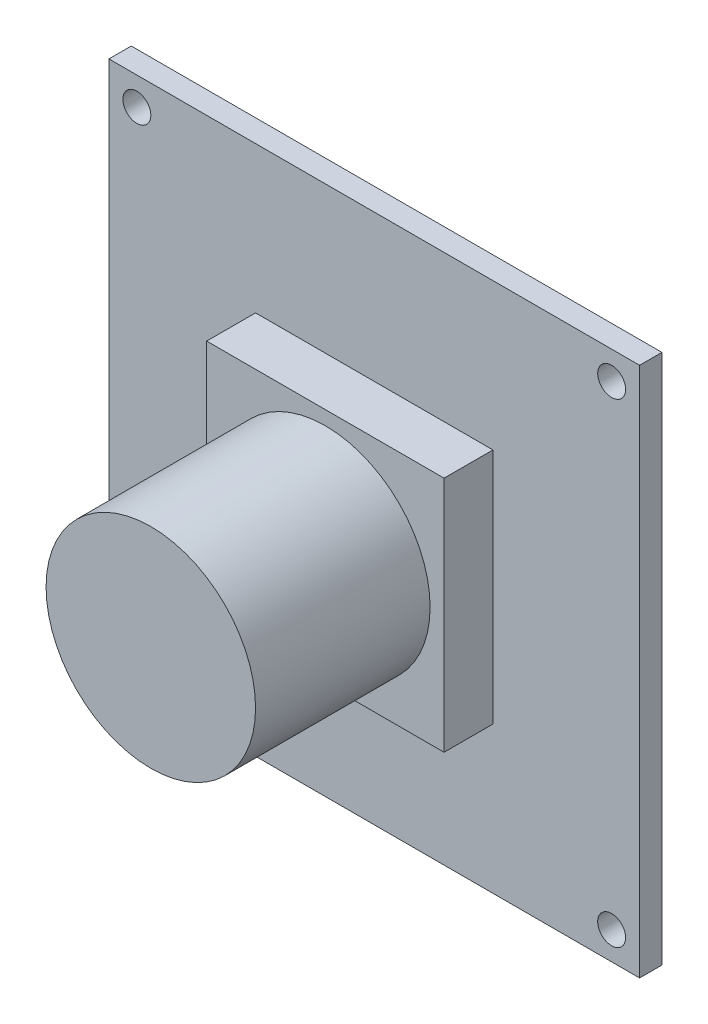
ISO-10303-21;
HEADER;
FILE_DESCRIPTION(('STEP AP214'),'2;1');
FILE_NAME('part.step','',(''),(''),'','','');
FILE_SCHEMA(('AUTOMOTIVE_DESIGN { 1 0 10303 214 1 1 1 1 }'));
ENDSEC;
DATA;
#1=APPLICATION_CONTEXT('core data for automotive mechanical design processes');
#2=APPLICATION_PROTOCOL_DEFINITION('international standard','automotive_design',2000,#1);
#3=PRODUCT_CONTEXT('',#1,'mechanical');
#4=PRODUCT('Part','Part','',(#3));
#5=PRODUCT_RELATED_PRODUCT_CATEGORY('part','',(#4));
#6=PRODUCT_DEFINITION_FORMATION('','',#4);
#7=PRODUCT_DEFINITION_CONTEXT('part definition',#1,'design');
#8=PRODUCT_DEFINITION('design','',#6,#7);
#9=PRODUCT_DEFINITION_SHAPE('','',#8);
#10=(LENGTH_UNIT() NAMED_UNIT(*) SI_UNIT(.MILLI.,.METRE.));
#11=(NAMED_UNIT(*) PLANE_ANGLE_UNIT() SI_UNIT($,.RADIAN.));
#12=(NAMED_UNIT(*) SI_UNIT($,.STERADIAN.) SOLID_ANGLE_UNIT());
#13=UNCERTAINTY_MEASURE_WITH_UNIT(LENGTH_MEASURE(1.E-05),#10,'distance_accuracy_value','');
#14=(GEOMETRIC_REPRESENTATION_CONTEXT(3) GLOBAL_UNCERTAINTY_ASSIGNED_CONTEXT((#13)) GLOBAL_UNIT_ASSIGNED_CONTEXT((#10,
#11,#12)) REPRESENTATION_CONTEXT('',''));
#15=CARTESIAN_POINT('',(0.,0.,0.));
#16=DIRECTION('',(0.,0.,1.));
#17=DIRECTION('',(1.,0.,0.));
#18=AXIS2_PLACEMENT_3D('',#15,#16,#17);
#19=CARTESIAN_POINT('',(0.,0.,-1.6));
#20=DIRECTION('',(0.,0.,-1.));
#21=DIRECTION('',(-1.,0.,0.));
#22=AXIS2_PLACEMENT_3D('',#19,#20,#21);
#23=PLANE('',#22);
#24=CARTESIAN_POINT('',(17.,17.,-1.6));
#25=DIRECTION('',(0.,0.,-1.));
#26=DIRECTION('',(-1.,0.,0.));
#27=AXIS2_PLACEMENT_3D('',#24,#25,#26);
#28=CIRCLE('',#27,1.);
#29=CARTESIAN_POINT('',(16.,17.,-1.6));
#30=VERTEX_POINT('',#29);
#31=EDGE_CURVE('E164',#30,#30,#28,.F.);
#32=ORIENTED_EDGE('',*,*,#31,.T.);
#33=EDGE_LOOP('',(#32));
#34=FACE_BOUND('',#33,.T.);
#35=CARTESIAN_POINT('',(-17.,-17.,-1.6));
#36=DIRECTION('',(0.,0.,-1.));
#37=DIRECTION('',(-1.,0.,0.));
#38=AXIS2_PLACEMENT_3D('',#35,#36,#37);
#39=CIRCLE('',#38,1.00000000000001);
#40=CARTESIAN_POINT('',(-18.,-17.,-1.6));
#41=VERTEX_POINT('',#40);
#42=EDGE_CURVE('E158',#41,#41,#39,.F.);
#43=ORIENTED_EDGE('',*,*,#42,.T.);
#44=EDGE_LOOP('',(#43));
#45=FACE_BOUND('',#44,.T.);
#46=CARTESIAN_POINT('',(17.,-17.,-1.6));
#47=DIRECTION('',(0.,0.,-1.));
#48=DIRECTION('',(-1.,0.,0.));
#49=AXIS2_PLACEMENT_3D('',#46,#47,#48);
#50=CIRCLE('',#49,1.);
#51=CARTESIAN_POINT('',(16.,-17.,-1.6));
#52=VERTEX_POINT('',#51);
#53=EDGE_CURVE('E149',#52,#52,#50,.F.);
#54=ORIENTED_EDGE('',*,*,#53,.T.);
#55=EDGE_LOOP('',(#54));
#56=FACE_BOUND('',#55,.T.);
#57=CARTESIAN_POINT('',(-17.,17.,-1.6));
#58=DIRECTION('',(0.,0.,-1.));
#59=DIRECTION('',(-1.,0.,0.));
#60=AXIS2_PLACEMENT_3D('',#57,#58,#59);
#61=CIRCLE('',#60,1.00000000000001);
#62=CARTESIAN_POINT('',(-18.,17.,-1.6));
#63=VERTEX_POINT('',#62);
#64=EDGE_CURVE('E163',#63,#63,#61,.F.);
#65=ORIENTED_EDGE('',*,*,#64,.T.);
#66=EDGE_LOOP('',(#65));
#67=FACE_BOUND('',#66,.T.);
#68=DIRECTION('',(0.,1.,0.));
#69=VECTOR('',#68,1.);
#70=CARTESIAN_POINT('',(19.,-19.,-1.6));
#71=LINE('',#70,#69);
#72=CARTESIAN_POINT('',(19.,-19.,-1.6));
#73=VERTEX_POINT('',#72);
#74=CARTESIAN_POINT('',(19.,19.,-1.6));
#75=VERTEX_POINT('',#74);
#76=EDGE_CURVE('E211',#73,#75,#71,.T.);
#77=ORIENTED_EDGE('',*,*,#76,.F.);
#78=DIRECTION('',(1.,0.,0.));
#79=VECTOR('',#78,1.);
#80=CARTESIAN_POINT('',(-19.,-19.,-1.6));
#81=LINE('',#80,#79);
#82=CARTESIAN_POINT('',(-19.,-19.,-1.6));
#83=VERTEX_POINT('',#82);
#84=EDGE_CURVE('E221',#83,#73,#81,.T.);
#85=ORIENTED_EDGE('',*,*,#84,.F.);
#86=DIRECTION('',(0.,-1.,0.));
#87=VECTOR('',#86,1.);
#88=CARTESIAN_POINT('',(-19.,-19.,-1.6));
#89=LINE('',#88,#87);
#90=CARTESIAN_POINT('',(-19.,19.,-1.6));
#91=VERTEX_POINT('',#90);
#92=EDGE_CURVE('E218',#91,#83,#89,.T.);
#93=ORIENTED_EDGE('',*,*,#92,.F.);
#94=DIRECTION('',(-1.,0.,0.));
#95=VECTOR('',#94,1.);
#96=CARTESIAN_POINT('',(-19.,19.,-1.6));
#97=LINE('',#96,#95);
#98=EDGE_CURVE('E214',#75,#91,#97,.T.);
#99=ORIENTED_EDGE('',*,*,#98,.F.);
#100=EDGE_LOOP('',(#77,#85,#93,#99));
#101=FACE_BOUND('',#100,.T.);
#102=DIRECTION('',(1.,0.,0.));
#103=VECTOR('',#102,1.);
#104=CARTESIAN_POINT('',(10.,-11.,-1.6));
#105=LINE('',#104,#103);
#106=CARTESIAN_POINT('',(0.,-11.,-1.6));
#107=VERTEX_POINT('',#106);
#108=CARTESIAN_POINT('',(10.,-11.,-1.6));
#109=VERTEX_POINT('',#108);
#110=EDGE_CURVE('E464',#107,#109,#105,.T.);
#111=ORIENTED_EDGE('',*,*,#110,.F.);
#112=DIRECTION('',(0.,1.,0.));
#113=VECTOR('',#112,1.);
#114=CARTESIAN_POINT('',(0.,-16.,-1.6));
#115=LINE('',#114,#113);
#116=CARTESIAN_POINT('',(0.,-16.,-1.6));
#117=VERTEX_POINT('',#116);
#118=EDGE_CURVE('E147',#117,#107,#115,.T.);
#119=ORIENTED_EDGE('',*,*,#118,.F.);
#120=DIRECTION('',(-1.,0.,0.));
#121=VECTOR('',#120,1.);
#122=CARTESIAN_POINT('',(10.,-16.,-1.6));
#123=LINE('',#122,#121);
#124=CARTESIAN_POINT('',(10.,-16.,-1.6));
#125=VERTEX_POINT('',#124);
#126=EDGE_CURVE('E143',#125,#117,#123,.T.);
#127=ORIENTED_EDGE('',*,*,#126,.F.);
#128=DIRECTION('',(0.,-1.,0.));
#129=VECTOR('',#128,1.);
#130=CARTESIAN_POINT('',(10.,-16.,-1.6));
#131=LINE('',#130,#129);
#132=EDGE_CURVE('E461',#109,#125,#131,.T.);
#133=ORIENTED_EDGE('',*,*,#132,.F.);
#134=EDGE_LOOP('',(#111,#119,#127,#133));
#135=FACE_BOUND('',#134,.T.);
#136=ADVANCED_FACE('F33',(#34,#45,#56,#67,#101,#135),#23,.T.);
#137=CARTESIAN_POINT('',(0.,0.,0.));
#138=DIRECTION('',(0.,0.,-1.));
#139=DIRECTION('',(-1.,0.,0.));
#140=AXIS2_PLACEMENT_3D('',#137,#138,#139);
#141=PLANE('',#140);
#142=CARTESIAN_POINT('',(17.,17.,0.));
#143=DIRECTION('',(0.,0.,1.));
#144=DIRECTION('',(-1.,0.,0.));
#145=AXIS2_PLACEMENT_3D('',#142,#143,#144);
#146=CIRCLE('',#145,1.);
#147=CARTESIAN_POINT('',(16.,17.,0.));
#148=VERTEX_POINT('',#147);
#149=EDGE_CURVE('E160',#148,#148,#146,.T.);
#150=ORIENTED_EDGE('',*,*,#149,.F.);
#151=EDGE_LOOP('',(#150));
#152=FACE_BOUND('',#151,.T.);
#153=CARTESIAN_POINT('',(-17.,-17.,0.));
#154=DIRECTION('',(0.,0.,1.));
#155=DIRECTION('',(-1.,0.,0.));
#156=AXIS2_PLACEMENT_3D('',#153,#154,#155);
#157=CIRCLE('',#156,1.00000000000001);
#158=CARTESIAN_POINT('',(-18.,-17.,0.));
#159=VERTEX_POINT('',#158);
#160=EDGE_CURVE('E167',#159,#159,#157,.T.);
#161=ORIENTED_EDGE('',*,*,#160,.F.);
#162=EDGE_LOOP('',(#161));
#163=FACE_BOUND('',#162,.T.);
#164=CARTESIAN_POINT('',(17.,-17.,0.));
#165=DIRECTION('',(0.,0.,1.));
#166=DIRECTION('',(1.,0.,0.));
#167=AXIS2_PLACEMENT_3D('',#164,#165,#166);
#168=CIRCLE('',#167,1.);
#169=CARTESIAN_POINT('',(18.,-17.,0.));
#170=VERTEX_POINT('',#169);
#171=EDGE_CURVE('E152',#170,#170,#168,.T.);
#172=ORIENTED_EDGE('',*,*,#171,.F.);
#173=EDGE_LOOP('',(#172));
#174=FACE_BOUND('',#173,.T.);
#175=CARTESIAN_POINT('',(-17.,17.,0.));
#176=DIRECTION('',(0.,0.,1.));
#177=DIRECTION('',(1.,0.,0.));
#178=AXIS2_PLACEMENT_3D('',#175,#176,#177);
#179=CIRCLE('',#178,1.00000000000001);
#180=CARTESIAN_POINT('',(-16.,17.,0.));
#181=VERTEX_POINT('',#180);
#182=EDGE_CURVE('E172',#181,#181,#179,.T.);
#183=ORIENTED_EDGE('',*,*,#182,.F.);
#184=EDGE_LOOP('',(#183));
#185=FACE_BOUND('',#184,.T.);
#186=DIRECTION('',(0.,1.,0.));
#187=VECTOR('',#186,1.);
#188=CARTESIAN_POINT('',(19.,-19.,0.));
#189=LINE('',#188,#187);
#190=CARTESIAN_POINT('',(19.,-19.,0.));
#191=VERTEX_POINT('',#190);
#192=CARTESIAN_POINT('',(19.,19.,0.));
#193=VERTEX_POINT('',#192);
#194=EDGE_CURVE('E210',#191,#193,#189,.T.);
#195=ORIENTED_EDGE('',*,*,#194,.T.);
#196=DIRECTION('',(-1.,0.,0.));
#197=VECTOR('',#196,1.);
#198=CARTESIAN_POINT('',(-19.,19.,0.));
#199=LINE('',#198,#197);
#200=CARTESIAN_POINT('',(-19.,19.,0.));
#201=VERTEX_POINT('',#200);
#202=EDGE_CURVE('E226',#193,#201,#199,.T.);
#203=ORIENTED_EDGE('',*,*,#202,.T.);
#204=DIRECTION('',(0.,-1.,0.));
#205=VECTOR('',#204,1.);
#206=CARTESIAN_POINT('',(-19.,-19.,0.));
#207=LINE('',#206,#205);
#208=CARTESIAN_POINT('',(-19.,-19.,0.));
#209=VERTEX_POINT('',#208);
#210=EDGE_CURVE('E229',#201,#209,#207,.T.);
#211=ORIENTED_EDGE('',*,*,#210,.T.);
#212=DIRECTION('',(1.,0.,0.));
#213=VECTOR('',#212,1.);
#214=CARTESIAN_POINT('',(-19.,-19.,0.));
#215=LINE('',#214,#213);
#216=EDGE_CURVE('E215',#209,#191,#215,.T.);
#217=ORIENTED_EDGE('',*,*,#216,.T.);
#218=EDGE_LOOP('',(#195,#203,#211,#217));
#219=FACE_BOUND('',#218,.T.);
#220=DIRECTION('',(0.,1.,0.));
#221=VECTOR('',#220,1.);
#222=CARTESIAN_POINT('',(8.5,-8.5,0.));
#223=LINE('',#222,#221);
#224=CARTESIAN_POINT('',(8.5,-8.5,0.));
#225=VERTEX_POINT('',#224);
#226=CARTESIAN_POINT('',(8.5,8.5,0.));
#227=VERTEX_POINT('',#226);
#228=EDGE_CURVE('E58',#225,#227,#223,.T.);
#229=ORIENTED_EDGE('',*,*,#228,.F.);
#230=DIRECTION('',(1.,0.,0.));
#231=VECTOR('',#230,1.);
#232=CARTESIAN_POINT('',(-8.5,-8.5,0.));
#233=LINE('',#232,#231);
#234=CARTESIAN_POINT('',(-8.5,-8.5,0.));
#235=VERTEX_POINT('',#234);
#236=EDGE_CURVE('E184',#235,#225,#233,.T.);
#237=ORIENTED_EDGE('',*,*,#236,.F.);
#238=DIRECTION('',(0.,-1.,0.));
#239=VECTOR('',#238,1.);
#240=CARTESIAN_POINT('',(-8.5,-8.5,0.));
#241=LINE('',#240,#239);
#242=CARTESIAN_POINT('',(-8.5,8.5,0.));
#243=VERTEX_POINT('',#242);
#244=EDGE_CURVE('E195',#243,#235,#241,.T.);
#245=ORIENTED_EDGE('',*,*,#244,.F.);
#246=DIRECTION('',(-1.,0.,0.));
#247=VECTOR('',#246,1.);
#248=CARTESIAN_POINT('',(-8.5,8.5,0.));
#249=LINE('',#248,#247);
#250=EDGE_CURVE('E192',#227,#243,#249,.T.);
#251=ORIENTED_EDGE('',*,*,#250,.F.);
#252=EDGE_LOOP('',(#229,#237,#245,#251));
#253=FACE_BOUND('',#252,.T.);
#254=ADVANCED_FACE('F246',(#152,#163,#174,#185,#219,#253),#141,.F.);
#255=CARTESIAN_POINT('',(19.,-19.,-1.6));
#256=DIRECTION('',(1.,0.,0.));
#257=DIRECTION('',(0.,0.,-1.));
#258=AXIS2_PLACEMENT_3D('',#255,#256,#257);
#259=PLANE('',#258);
#260=ORIENTED_EDGE('',*,*,#194,.F.);
#261=DIRECTION('',(0.,0.,1.));
#262=VECTOR('',#261,1.);
#263=CARTESIAN_POINT('',(19.,-19.,-1.6));
#264=LINE('',#263,#262);
#265=EDGE_CURVE('E42',#73,#191,#264,.T.);
#266=ORIENTED_EDGE('',*,*,#265,.F.);
#267=ORIENTED_EDGE('',*,*,#76,.T.);
#268=DIRECTION('',(0.,0.,1.));
#269=VECTOR('',#268,1.);
#270=CARTESIAN_POINT('',(19.,19.,-1.6));
#271=LINE('',#270,#269);
#272=EDGE_CURVE('E37',#75,#193,#271,.T.);
#273=ORIENTED_EDGE('',*,*,#272,.T.);
#274=EDGE_LOOP('',(#260,#266,#267,#273));
#275=FACE_BOUND('',#274,.T.);
#276=ADVANCED_FACE('F35',(#275),#259,.T.);
#277=CARTESIAN_POINT('',(-19.,-19.,-1.6));
#278=DIRECTION('',(0.,-1.,0.));
#279=DIRECTION('',(0.,0.,-1.));
#280=AXIS2_PLACEMENT_3D('',#277,#278,#279);
#281=PLANE('',#280);
#282=ORIENTED_EDGE('',*,*,#216,.F.);
#283=DIRECTION('',(0.,0.,1.));
#284=VECTOR('',#283,1.);
#285=CARTESIAN_POINT('',(-19.,-19.,-1.6));
#286=LINE('',#285,#284);
#287=EDGE_CURVE('E235',#83,#209,#286,.T.);
#288=ORIENTED_EDGE('',*,*,#287,.F.);
#289=ORIENTED_EDGE('',*,*,#84,.T.);
#290=ORIENTED_EDGE('',*,*,#265,.T.);
#291=EDGE_LOOP('',(#282,#288,#289,#290));
#292=FACE_BOUND('',#291,.T.);
#293=ADVANCED_FACE('F249',(#292),#281,.T.);
#294=CARTESIAN_POINT('',(-19.,-19.,-1.6));
#295=DIRECTION('',(-1.,0.,0.));
#296=DIRECTION('',(0.,0.,1.));
#297=AXIS2_PLACEMENT_3D('',#294,#295,#296);
#298=PLANE('',#297);
#299=ORIENTED_EDGE('',*,*,#210,.F.);
#300=DIRECTION('',(0.,0.,1.));
#301=VECTOR('',#300,1.);
#302=CARTESIAN_POINT('',(-19.,19.,-1.6));
#303=LINE('',#302,#301);
#304=EDGE_CURVE('E236',#91,#201,#303,.T.);
#305=ORIENTED_EDGE('',*,*,#304,.F.);
#306=ORIENTED_EDGE('',*,*,#92,.T.);
#307=ORIENTED_EDGE('',*,*,#287,.T.);
#308=EDGE_LOOP('',(#299,#305,#306,#307));
#309=FACE_BOUND('',#308,.T.);
#310=ADVANCED_FACE('F255',(#309),#298,.T.);
#311=CARTESIAN_POINT('',(-19.,19.,-1.6));
#312=DIRECTION('',(0.,1.,0.));
#313=DIRECTION('',(0.,0.,1.));
#314=AXIS2_PLACEMENT_3D('',#311,#312,#313);
#315=PLANE('',#314);
#316=ORIENTED_EDGE('',*,*,#202,.F.);
#317=ORIENTED_EDGE('',*,*,#272,.F.);
#318=ORIENTED_EDGE('',*,*,#98,.T.);
#319=ORIENTED_EDGE('',*,*,#304,.T.);
#320=EDGE_LOOP('',(#316,#317,#318,#319));
#321=FACE_BOUND('',#320,.T.);
#322=ADVANCED_FACE('F244',(#321),#315,.T.);
#323=CARTESIAN_POINT('',(8.5,-8.5,3.5));
#324=DIRECTION('',(-1.,0.,0.));
#325=DIRECTION('',(0.,0.,1.));
#326=AXIS2_PLACEMENT_3D('',#323,#324,#325);
#327=PLANE('',#326);
#328=ORIENTED_EDGE('',*,*,#228,.T.);
#329=DIRECTION('',(0.,0.,-1.));
#330=VECTOR('',#329,1.);
#331=CARTESIAN_POINT('',(8.5,8.5,3.5));
#332=LINE('',#331,#330);
#333=CARTESIAN_POINT('',(8.5,8.5,3.5));
#334=VERTEX_POINT('',#333);
#335=EDGE_CURVE('E207',#334,#227,#332,.T.);
#336=ORIENTED_EDGE('',*,*,#335,.F.);
#337=DIRECTION('',(0.,1.,0.));
#338=VECTOR('',#337,1.);
#339=CARTESIAN_POINT('',(8.5,-8.5,3.5));
#340=LINE('',#339,#338);
#341=CARTESIAN_POINT('',(8.5,-8.5,3.5));
#342=VERTEX_POINT('',#341);
#343=EDGE_CURVE('E180',#342,#334,#340,.T.);
#344=ORIENTED_EDGE('',*,*,#343,.F.);
#345=DIRECTION('',(0.,0.,-1.));
#346=VECTOR('',#345,1.);
#347=CARTESIAN_POINT('',(8.5,-8.5,3.5));
#348=LINE('',#347,#346);
#349=EDGE_CURVE('E190',#342,#225,#348,.T.);
#350=ORIENTED_EDGE('',*,*,#349,.T.);
#351=EDGE_LOOP('',(#328,#336,#344,#350));
#352=FACE_BOUND('',#351,.T.);
#353=ADVANCED_FACE('F262',(#352),#327,.F.);
#354=CARTESIAN_POINT('',(-8.5,8.5,3.5));
#355=DIRECTION('',(0.,-1.,0.));
#356=DIRECTION('',(0.,0.,-1.));
#357=AXIS2_PLACEMENT_3D('',#354,#355,#356);
#358=PLANE('',#357);
#359=ORIENTED_EDGE('',*,*,#250,.T.);
#360=DIRECTION('',(0.,0.,-1.));
#361=VECTOR('',#360,1.);
#362=CARTESIAN_POINT('',(-8.5,8.5,3.5));
#363=LINE('',#362,#361);
#364=CARTESIAN_POINT('',(-8.5,8.5,3.5));
#365=VERTEX_POINT('',#364);
#366=EDGE_CURVE('E204',#365,#243,#363,.T.);
#367=ORIENTED_EDGE('',*,*,#366,.F.);
#368=DIRECTION('',(-1.,0.,0.));
#369=VECTOR('',#368,1.);
#370=CARTESIAN_POINT('',(-8.5,8.5,3.5));
#371=LINE('',#370,#369);
#372=EDGE_CURVE('E183',#334,#365,#371,.T.);
#373=ORIENTED_EDGE('',*,*,#372,.F.);
#374=ORIENTED_EDGE('',*,*,#335,.T.);
#375=EDGE_LOOP('',(#359,#367,#373,#374));
#376=FACE_BOUND('',#375,.T.);
#377=ADVANCED_FACE('F276',(#376),#358,.F.);
#378=CARTESIAN_POINT('',(-8.5,-8.5,3.5));
#379=DIRECTION('',(1.,0.,0.));
#380=DIRECTION('',(0.,0.,-1.));
#381=AXIS2_PLACEMENT_3D('',#378,#379,#380);
#382=PLANE('',#381);
#383=ORIENTED_EDGE('',*,*,#244,.T.);
#384=DIRECTION('',(0.,0.,-1.));
#385=VECTOR('',#384,1.);
#386=CARTESIAN_POINT('',(-8.5,-8.5,3.5));
#387=LINE('',#386,#385);
#388=CARTESIAN_POINT('',(-8.5,-8.5,3.5));
#389=VERTEX_POINT('',#388);
#390=EDGE_CURVE('E201',#389,#235,#387,.T.);
#391=ORIENTED_EDGE('',*,*,#390,.F.);
#392=DIRECTION('',(0.,-1.,0.));
#393=VECTOR('',#392,1.);
#394=CARTESIAN_POINT('',(-8.5,-8.5,3.5));
#395=LINE('',#394,#393);
#396=EDGE_CURVE('E186',#365,#389,#395,.T.);
#397=ORIENTED_EDGE('',*,*,#396,.F.);
#398=ORIENTED_EDGE('',*,*,#366,.T.);
#399=EDGE_LOOP('',(#383,#391,#397,#398));
#400=FACE_BOUND('',#399,.T.);
#401=ADVANCED_FACE('F280',(#400),#382,.F.);
#402=CARTESIAN_POINT('',(-8.5,-8.5,3.5));
#403=DIRECTION('',(0.,1.,0.));
#404=DIRECTION('',(0.,0.,1.));
#405=AXIS2_PLACEMENT_3D('',#402,#403,#404);
#406=PLANE('',#405);
#407=ORIENTED_EDGE('',*,*,#236,.T.);
#408=ORIENTED_EDGE('',*,*,#349,.F.);
#409=DIRECTION('',(1.,0.,0.));
#410=VECTOR('',#409,1.);
#411=CARTESIAN_POINT('',(-8.5,-8.5,3.5));
#412=LINE('',#411,#410);
#413=EDGE_CURVE('E188',#389,#342,#412,.T.);
#414=ORIENTED_EDGE('',*,*,#413,.F.);
#415=ORIENTED_EDGE('',*,*,#390,.T.);
#416=EDGE_LOOP('',(#407,#408,#414,#415));
#417=FACE_BOUND('',#416,.T.);
#418=ADVANCED_FACE('F284',(#417),#406,.F.);
#419=CARTESIAN_POINT('',(0.,0.,3.5));
#420=DIRECTION('',(0.,0.,-1.));
#421=DIRECTION('',(-1.,0.,0.));
#422=AXIS2_PLACEMENT_3D('',#419,#420,#421);
#423=PLANE('',#422);
#424=CARTESIAN_POINT('',(0.,0.,3.5));
#425=DIRECTION('',(0.,0.,1.));
#426=DIRECTION('',(1.,0.,0.));
#427=AXIS2_PLACEMENT_3D('',#424,#425,#426);
#428=CIRCLE('',#427,7.5);
#429=CARTESIAN_POINT('',(7.5,0.,3.5));
#430=VERTEX_POINT('',#429);
#431=EDGE_CURVE('E11',#430,#430,#428,.T.);
#432=ORIENTED_EDGE('',*,*,#431,.F.);
#433=EDGE_LOOP('',(#432));
#434=FACE_BOUND('',#433,.T.);
#435=ORIENTED_EDGE('',*,*,#343,.T.);
#436=ORIENTED_EDGE('',*,*,#372,.T.);
#437=ORIENTED_EDGE('',*,*,#396,.T.);
#438=ORIENTED_EDGE('',*,*,#413,.T.);
#439=EDGE_LOOP('',(#435,#436,#437,#438));
#440=FACE_BOUND('',#439,.T.);
#441=ADVANCED_FACE('F288',(#434,#440),#423,.F.);
#442=CARTESIAN_POINT('',(0.,0.,16.));
#443=DIRECTION('',(0.,0.,-1.));
#444=DIRECTION('',(-1.,0.,0.));
#445=AXIS2_PLACEMENT_3D('',#442,#443,#444);
#446=CYLINDRICAL_SURFACE('',#445,7.5);
#447=CARTESIAN_POINT('',(0.,0.,16.));
#448=DIRECTION('',(0.,0.,1.));
#449=DIRECTION('',(1.,0.,0.));
#450=AXIS2_PLACEMENT_3D('',#447,#448,#449);
#451=CIRCLE('',#450,7.5);
#452=CARTESIAN_POINT('',(7.5,0.,16.));
#453=VERTEX_POINT('',#452);
#454=EDGE_CURVE('E175',#453,#453,#451,.T.);
#455=ORIENTED_EDGE('',*,*,#454,.F.);
#456=EDGE_LOOP('',(#455));
#457=FACE_BOUND('',#456,.T.);
#458=ORIENTED_EDGE('',*,*,#431,.T.);
#459=EDGE_LOOP('',(#458));
#460=FACE_BOUND('',#459,.T.);
#461=ADVANCED_FACE('F292',(#457,#460),#446,.T.);
#462=CARTESIAN_POINT('',(0.,0.,16.));
#463=DIRECTION('',(0.,0.,1.));
#464=DIRECTION('',(1.,0.,0.));
#465=AXIS2_PLACEMENT_3D('',#462,#463,#464);
#466=PLANE('',#465);
#467=ORIENTED_EDGE('',*,*,#454,.T.);
#468=EDGE_LOOP('',(#467));
#469=FACE_BOUND('',#468,.T.);
#470=ADVANCED_FACE('F296',(#469),#466,.T.);
#471=CARTESIAN_POINT('',(-17.,17.,-1.601));
#472=DIRECTION('',(0.,0.,1.));
#473=DIRECTION('',(1.,0.,0.));
#474=AXIS2_PLACEMENT_3D('',#471,#472,#473);
#475=CYLINDRICAL_SURFACE('',#474,1.00000000000001);
#476=ORIENTED_EDGE('',*,*,#64,.F.);
#477=EDGE_LOOP('',(#476));
#478=FACE_BOUND('',#477,.T.);
#479=ORIENTED_EDGE('',*,*,#182,.T.);
#480=EDGE_LOOP('',(#479));
#481=FACE_BOUND('',#480,.T.);
#482=ADVANCED_FACE('F300',(#478,#481),#475,.F.);
#483=CARTESIAN_POINT('',(17.,-17.,-1.601));
#484=DIRECTION('',(0.,0.,1.));
#485=DIRECTION('',(1.,0.,0.));
#486=AXIS2_PLACEMENT_3D('',#483,#484,#485);
#487=CYLINDRICAL_SURFACE('',#486,1.);
#488=ORIENTED_EDGE('',*,*,#53,.F.);
#489=EDGE_LOOP('',(#488));
#490=FACE_BOUND('',#489,.T.);
#491=ORIENTED_EDGE('',*,*,#171,.T.);
#492=EDGE_LOOP('',(#491));
#493=FACE_BOUND('',#492,.T.);
#494=ADVANCED_FACE('F304',(#490,#493),#487,.F.);
#495=CARTESIAN_POINT('',(-17.,-17.,-1.601));
#496=DIRECTION('',(0.,0.,1.));
#497=DIRECTION('',(1.,0.,0.));
#498=AXIS2_PLACEMENT_3D('',#495,#496,#497);
#499=CYLINDRICAL_SURFACE('',#498,1.00000000000001);
#500=ORIENTED_EDGE('',*,*,#42,.F.);
#501=EDGE_LOOP('',(#500));
#502=FACE_BOUND('',#501,.T.);
#503=ORIENTED_EDGE('',*,*,#160,.T.);
#504=EDGE_LOOP('',(#503));
#505=FACE_BOUND('',#504,.T.);
#506=ADVANCED_FACE('F306',(#502,#505),#499,.F.);
#507=CARTESIAN_POINT('',(17.,17.,-1.601));
#508=DIRECTION('',(0.,0.,1.));
#509=DIRECTION('',(1.,0.,0.));
#510=AXIS2_PLACEMENT_3D('',#507,#508,#509);
#511=CYLINDRICAL_SURFACE('',#510,1.);
#512=ORIENTED_EDGE('',*,*,#31,.F.);
#513=EDGE_LOOP('',(#512));
#514=FACE_BOUND('',#513,.T.);
#515=ORIENTED_EDGE('',*,*,#149,.T.);
#516=EDGE_LOOP('',(#515));
#517=FACE_BOUND('',#516,.T.);
#518=ADVANCED_FACE('F309',(#514,#517),#511,.F.);
#519=CARTESIAN_POINT('',(0.,-16.,-9.6));
#520=DIRECTION('',(1.,0.,0.));
#521=DIRECTION('',(0.,0.,-1.));
#522=AXIS2_PLACEMENT_3D('',#519,#520,#521);
#523=PLANE('',#522);
#524=ORIENTED_EDGE('',*,*,#118,.T.);
#525=DIRECTION('',(0.,0.,1.));
#526=VECTOR('',#525,1.);
#527=CARTESIAN_POINT('',(0.,-11.,-9.6));
#528=LINE('',#527,#526);
#529=CARTESIAN_POINT('',(0.,-11.,-9.6));
#530=VERTEX_POINT('',#529);
#531=EDGE_CURVE('E128',#530,#107,#528,.T.);
#532=ORIENTED_EDGE('',*,*,#531,.F.);
#533=DIRECTION('',(0.,1.,0.));
#534=VECTOR('',#533,1.);
#535=CARTESIAN_POINT('',(0.,-16.,-9.6));
#536=LINE('',#535,#534);
#537=CARTESIAN_POINT('',(0.,-16.,-9.6));
#538=VERTEX_POINT('',#537);
#539=EDGE_CURVE('E135',#538,#530,#536,.T.);
#540=ORIENTED_EDGE('',*,*,#539,.F.);
#541=DIRECTION('',(0.,0.,1.));
#542=VECTOR('',#541,1.);
#543=CARTESIAN_POINT('',(0.,-16.,-9.6));
#544=LINE('',#543,#542);
#545=EDGE_CURVE('E459',#538,#117,#544,.T.);
#546=ORIENTED_EDGE('',*,*,#545,.T.);
#547=EDGE_LOOP('',(#524,#532,#540,#546));
#548=FACE_BOUND('',#547,.T.);
#549=ADVANCED_FACE('F145',(#548),#523,.F.);
#550=CARTESIAN_POINT('',(10.,-11.,-9.6));
#551=DIRECTION('',(0.,-1.,0.));
#552=DIRECTION('',(0.,0.,-1.));
#553=AXIS2_PLACEMENT_3D('',#550,#551,#552);
#554=PLANE('',#553);
#555=ORIENTED_EDGE('',*,*,#110,.T.);
#556=DIRECTION('',(0.,0.,1.));
#557=VECTOR('',#556,1.);
#558=CARTESIAN_POINT('',(10.,-11.,-9.6));
#559=LINE('',#558,#557);
#560=CARTESIAN_POINT('',(10.,-11.,-9.6));
#561=VERTEX_POINT('',#560);
#562=EDGE_CURVE('E131',#561,#109,#559,.T.);
#563=ORIENTED_EDGE('',*,*,#562,.F.);
#564=DIRECTION('',(1.,0.,0.));
#565=VECTOR('',#564,1.);
#566=CARTESIAN_POINT('',(10.,-11.,-9.6));
#567=LINE('',#566,#565);
#568=EDGE_CURVE('E124',#530,#561,#567,.T.);
#569=ORIENTED_EDGE('',*,*,#568,.F.);
#570=ORIENTED_EDGE('',*,*,#531,.T.);
#571=EDGE_LOOP('',(#555,#563,#569,#570));
#572=FACE_BOUND('',#571,.T.);
#573=ADVANCED_FACE('F126',(#572),#554,.F.);
#574=CARTESIAN_POINT('',(10.,-16.,-9.6));
#575=DIRECTION('',(-1.,0.,0.));
#576=DIRECTION('',(0.,0.,1.));
#577=AXIS2_PLACEMENT_3D('',#574,#575,#576);
#578=PLANE('',#577);
#579=ORIENTED_EDGE('',*,*,#132,.T.);
#580=DIRECTION('',(0.,0.,1.));
#581=VECTOR('',#580,1.);
#582=CARTESIAN_POINT('',(10.,-16.,-9.6));
#583=LINE('',#582,#581);
#584=CARTESIAN_POINT('',(10.,-16.,-9.6));
#585=VERTEX_POINT('',#584);
#586=EDGE_CURVE('E50',#585,#125,#583,.T.);
#587=ORIENTED_EDGE('',*,*,#586,.F.);
#588=DIRECTION('',(0.,-1.,0.));
#589=VECTOR('',#588,1.);
#590=CARTESIAN_POINT('',(10.,-16.,-9.6));
#591=LINE('',#590,#589);
#592=EDGE_CURVE('E134',#561,#585,#591,.T.);
#593=ORIENTED_EDGE('',*,*,#592,.F.);
#594=ORIENTED_EDGE('',*,*,#562,.T.);
#595=EDGE_LOOP('',(#579,#587,#593,#594));
#596=FACE_BOUND('',#595,.T.);
#597=ADVANCED_FACE('F321',(#596),#578,.F.);
#598=CARTESIAN_POINT('',(10.,-16.,-9.6));
#599=DIRECTION('',(0.,1.,0.));
#600=DIRECTION('',(0.,0.,1.));
#601=AXIS2_PLACEMENT_3D('',#598,#599,#600);
#602=PLANE('',#601);
#603=ORIENTED_EDGE('',*,*,#126,.T.);
#604=ORIENTED_EDGE('',*,*,#545,.F.);
#605=DIRECTION('',(-1.,0.,0.));
#606=VECTOR('',#605,1.);
#607=CARTESIAN_POINT('',(10.,-16.,-9.6));
#608=LINE('',#607,#606);
#609=EDGE_CURVE('E139',#585,#538,#608,.T.);
#610=ORIENTED_EDGE('',*,*,#609,.F.);
#611=ORIENTED_EDGE('',*,*,#586,.T.);
#612=EDGE_LOOP('',(#603,#604,#610,#611));
#613=FACE_BOUND('',#612,.T.);
#614=ADVANCED_FACE('F324',(#613),#602,.F.);
#615=CARTESIAN_POINT('',(0.,0.,-9.6));
#616=DIRECTION('',(0.,0.,1.));
#617=DIRECTION('',(1.,0.,0.));
#618=AXIS2_PLACEMENT_3D('',#615,#616,#617);
#619=PLANE('',#618);
#620=ORIENTED_EDGE('',*,*,#539,.T.);
#621=ORIENTED_EDGE('',*,*,#568,.T.);
#622=ORIENTED_EDGE('',*,*,#592,.T.);
#623=ORIENTED_EDGE('',*,*,#609,.T.);
#624=EDGE_LOOP('',(#620,#621,#622,#623));
#625=FACE_BOUND('',#624,.T.);
#626=ADVANCED_FACE('F138',(#625),#619,.F.);
#627=CLOSED_SHELL('',(#136,#254,#276,#293,#310,#322,#353,#377,#401,#418,#441,#461,#470,#482,
#494,#506,#518,#549,#573,#597,#614,#626));
#628=MANIFOLD_SOLID_BREP('B2',#627);
#629=ADVANCED_BREP_SHAPE_REPRESENTATION('',(#18,#628),#14);
#630=SHAPE_DEFINITION_REPRESENTATION(#9,#629);
ENDSEC;
END-ISO-10303-21;
